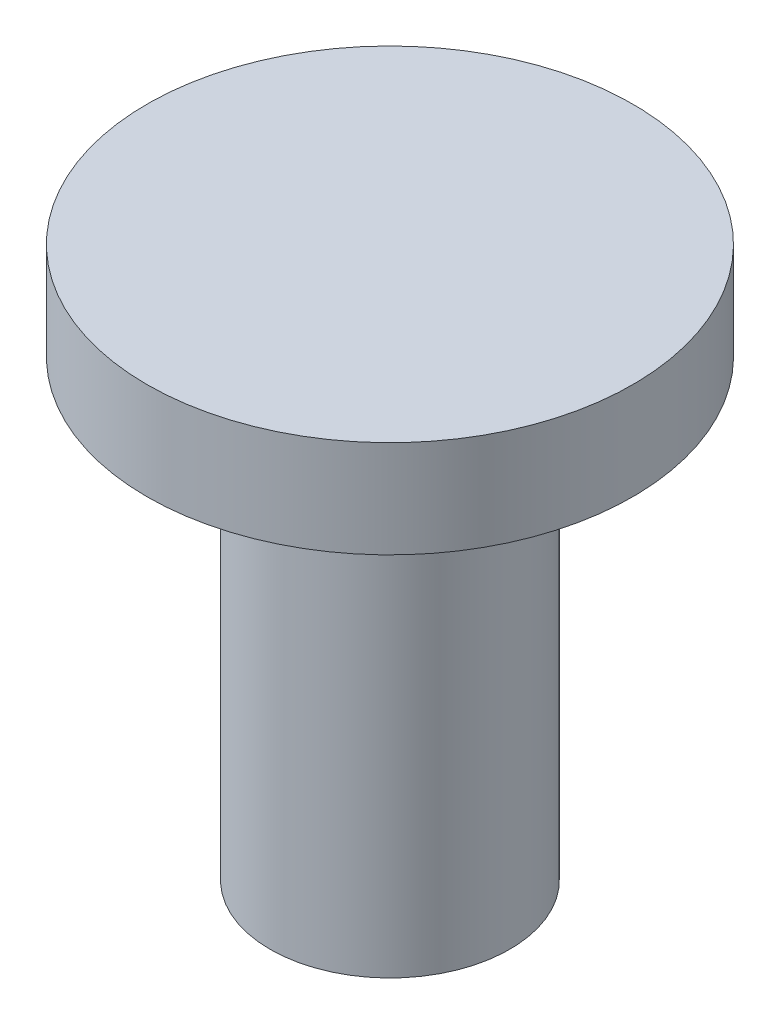
ISO-10303-21;
HEADER;
FILE_DESCRIPTION(('STEP AP214'),'2;1');
FILE_NAME('part.step','',(''),(''),'','','');
FILE_SCHEMA(('AUTOMOTIVE_DESIGN { 1 0 10303 214 1 1 1 1 }'));
ENDSEC;
DATA;
#1=APPLICATION_CONTEXT('core data for automotive mechanical design processes');
#2=APPLICATION_PROTOCOL_DEFINITION('international standard','automotive_design',2000,#1);
#3=PRODUCT_CONTEXT('',#1,'mechanical');
#4=PRODUCT('Part','Part','',(#3));
#5=PRODUCT_RELATED_PRODUCT_CATEGORY('part','',(#4));
#6=PRODUCT_DEFINITION_FORMATION('','',#4);
#7=PRODUCT_DEFINITION_CONTEXT('part definition',#1,'design');
#8=PRODUCT_DEFINITION('design','',#6,#7);
#9=PRODUCT_DEFINITION_SHAPE('','',#8);
#10=(LENGTH_UNIT() NAMED_UNIT(*) SI_UNIT(.MILLI.,.METRE.));
#11=(NAMED_UNIT(*) PLANE_ANGLE_UNIT() SI_UNIT($,.RADIAN.));
#12=(NAMED_UNIT(*) SI_UNIT($,.STERADIAN.) SOLID_ANGLE_UNIT());
#13=UNCERTAINTY_MEASURE_WITH_UNIT(LENGTH_MEASURE(1.E-05),#10,'distance_accuracy_value','');
#14=(GEOMETRIC_REPRESENTATION_CONTEXT(3) GLOBAL_UNCERTAINTY_ASSIGNED_CONTEXT((#13)) GLOBAL_UNIT_ASSIGNED_CONTEXT((#10,
#11,#12)) REPRESENTATION_CONTEXT('',''));
#15=CARTESIAN_POINT('',(0.,0.,0.));
#16=DIRECTION('',(0.,0.,1.));
#17=DIRECTION('',(1.,0.,0.));
#18=AXIS2_PLACEMENT_3D('',#15,#16,#17);
#19=CARTESIAN_POINT('',(0.,9.42265193370165,-2.0524861878453));
#20=DIRECTION('',(0.,1.,0.));
#21=DIRECTION('',(0.,0.,1.));
#22=AXIS2_PLACEMENT_3D('',#19,#20,#21);
#23=PLANE('',#22);
#24=CARTESIAN_POINT('',(0.,9.42265193370166,-2.0524861878453));
#25=DIRECTION('',(0.,1.,0.));
#26=DIRECTION('',(0.,0.,1.));
#27=AXIS2_PLACEMENT_3D('',#24,#25,#26);
#28=CIRCLE('',#27,7.5);
#29=CARTESIAN_POINT('',(0.,9.42265193370165,5.4475138121547));
#30=VERTEX_POINT('',#29);
#31=EDGE_CURVE('E10',#30,#30,#28,.T.);
#32=ORIENTED_EDGE('',*,*,#31,.T.);
#33=EDGE_LOOP('',(#32));
#34=FACE_BOUND('',#33,.T.);
#35=ADVANCED_FACE('F39',(#34),#23,.T.);
#36=CARTESIAN_POINT('',(0.,9.42265193370166,-2.0524861878453));
#37=DIRECTION('',(0.,1.,0.));
#38=DIRECTION('',(0.,0.,1.));
#39=AXIS2_PLACEMENT_3D('',#36,#37,#38);
#40=CYLINDRICAL_SURFACE('',#39,7.5);
#41=CARTESIAN_POINT('',(0.,6.42265193370166,-2.0524861878453));
#42=DIRECTION('',(0.,1.,0.));
#43=DIRECTION('',(0.,0.,1.));
#44=AXIS2_PLACEMENT_3D('',#41,#42,#43);
#45=CIRCLE('',#44,7.5);
#46=CARTESIAN_POINT('',(0.,6.42265193370165,5.4475138121547));
#47=VERTEX_POINT('',#46);
#48=EDGE_CURVE('E46',#47,#47,#45,.T.);
#49=ORIENTED_EDGE('',*,*,#48,.T.);
#50=EDGE_LOOP('',(#49));
#51=FACE_BOUND('',#50,.T.);
#52=ORIENTED_EDGE('',*,*,#31,.F.);
#53=EDGE_LOOP('',(#52));
#54=FACE_BOUND('',#53,.T.);
#55=ADVANCED_FACE('F75',(#51,#54),#40,.T.);
#56=CARTESIAN_POINT('',(0.,6.42265193370165,5.4475138121547));
#57=DIRECTION('',(0.,-1.,0.));
#58=DIRECTION('',(0.,0.,-1.));
#59=AXIS2_PLACEMENT_3D('',#56,#57,#58);
#60=PLANE('',#59);
#61=CARTESIAN_POINT('',(0.,6.42265193370166,-2.0524861878453));
#62=DIRECTION('',(0.,1.,0.));
#63=DIRECTION('',(0.,0.,1.));
#64=AXIS2_PLACEMENT_3D('',#61,#62,#63);
#65=CIRCLE('',#64,3.7);
#66=CARTESIAN_POINT('',(0.,6.42265193370165,1.6475138121547));
#67=VERTEX_POINT('',#66);
#68=EDGE_CURVE('E51',#67,#67,#65,.T.);
#69=ORIENTED_EDGE('',*,*,#68,.T.);
#70=EDGE_LOOP('',(#69));
#71=FACE_BOUND('',#70,.T.);
#72=ORIENTED_EDGE('',*,*,#48,.F.);
#73=EDGE_LOOP('',(#72));
#74=FACE_BOUND('',#73,.T.);
#75=ADVANCED_FACE('F72',(#71,#74),#60,.T.);
#76=CARTESIAN_POINT('',(0.,9.42265193370166,-2.0524861878453));
#77=DIRECTION('',(0.,1.,0.));
#78=DIRECTION('',(0.,0.,1.));
#79=AXIS2_PLACEMENT_3D('',#76,#77,#78);
#80=CYLINDRICAL_SURFACE('',#79,3.7);
#81=CARTESIAN_POINT('',(0.,-7.57734806629834,-2.05248618784531));
#82=DIRECTION('',(0.,1.,0.));
#83=DIRECTION('',(0.,0.,1.));
#84=AXIS2_PLACEMENT_3D('',#81,#82,#83);
#85=CIRCLE('',#84,3.7);
#86=CARTESIAN_POINT('',(0.,-7.57734806629835,1.6475138121547));
#87=VERTEX_POINT('',#86);
#88=EDGE_CURVE('E56',#87,#87,#85,.T.);
#89=ORIENTED_EDGE('',*,*,#88,.T.);
#90=EDGE_LOOP('',(#89));
#91=FACE_BOUND('',#90,.T.);
#92=ORIENTED_EDGE('',*,*,#68,.F.);
#93=EDGE_LOOP('',(#92));
#94=FACE_BOUND('',#93,.T.);
#95=ADVANCED_FACE('F63',(#91,#94),#80,.T.);
#96=CARTESIAN_POINT('',(0.,-7.57734806629835,1.6475138121547));
#97=DIRECTION('',(0.,-1.,0.));
#98=DIRECTION('',(0.,0.,-1.));
#99=AXIS2_PLACEMENT_3D('',#96,#97,#98);
#100=PLANE('',#99);
#101=ORIENTED_EDGE('',*,*,#88,.F.);
#102=EDGE_LOOP('',(#101));
#103=FACE_BOUND('',#102,.T.);
#104=ADVANCED_FACE('F66',(#103),#100,.T.);
#105=CLOSED_SHELL('',(#35,#55,#75,#95,#104));
#106=MANIFOLD_SOLID_BREP('B2',#105);
#107=ADVANCED_BREP_SHAPE_REPRESENTATION('',(#18,#106),#14);
#108=SHAPE_DEFINITION_REPRESENTATION(#9,#107);
ENDSEC;
END-ISO-10303-21;
